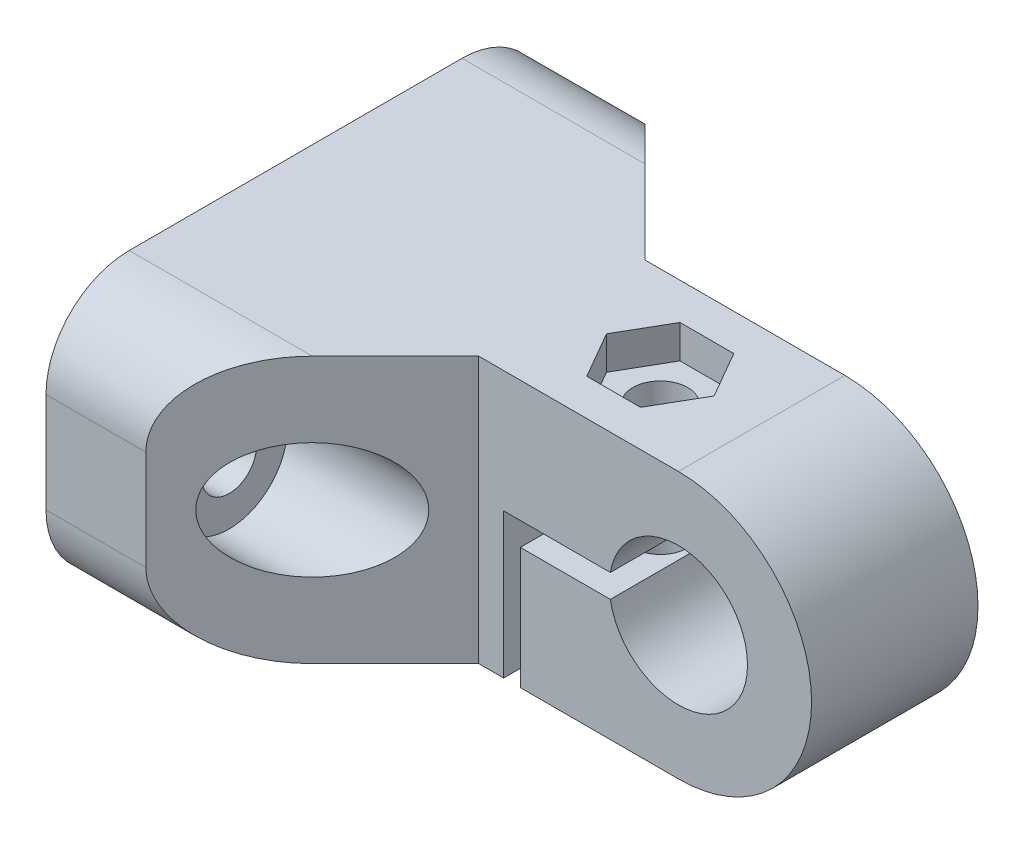
ISO-10303-21;
HEADER;
FILE_DESCRIPTION(('STEP AP214'),'2;1');
FILE_NAME('part.step','',(''),(''),'','','');
FILE_SCHEMA(('AUTOMOTIVE_DESIGN { 1 0 10303 214 1 1 1 1 }'));
ENDSEC;
DATA;
#1=APPLICATION_CONTEXT('core data for automotive mechanical design processes');
#2=APPLICATION_PROTOCOL_DEFINITION('international standard','automotive_design',2000,#1);
#3=PRODUCT_CONTEXT('',#1,'mechanical');
#4=PRODUCT('Part','Part','',(#3));
#5=PRODUCT_RELATED_PRODUCT_CATEGORY('part','',(#4));
#6=PRODUCT_DEFINITION_FORMATION('','',#4);
#7=PRODUCT_DEFINITION_CONTEXT('part definition',#1,'design');
#8=PRODUCT_DEFINITION('design','',#6,#7);
#9=PRODUCT_DEFINITION_SHAPE('','',#8);
#10=(LENGTH_UNIT() NAMED_UNIT(*) SI_UNIT(.MILLI.,.METRE.));
#11=(NAMED_UNIT(*) PLANE_ANGLE_UNIT() SI_UNIT($,.RADIAN.));
#12=(NAMED_UNIT(*) SI_UNIT($,.STERADIAN.) SOLID_ANGLE_UNIT());
#13=UNCERTAINTY_MEASURE_WITH_UNIT(LENGTH_MEASURE(1.E-05),#10,'distance_accuracy_value','');
#14=(GEOMETRIC_REPRESENTATION_CONTEXT(3) GLOBAL_UNCERTAINTY_ASSIGNED_CONTEXT((#13)) GLOBAL_UNIT_ASSIGNED_CONTEXT((#10,
#11,#12)) REPRESENTATION_CONTEXT('',''));
#15=CARTESIAN_POINT('',(0.,0.,0.));
#16=DIRECTION('',(0.,0.,1.));
#17=DIRECTION('',(1.,0.,0.));
#18=AXIS2_PLACEMENT_3D('',#15,#16,#17);
#19=CARTESIAN_POINT('',(8.,0.,5.));
#20=DIRECTION('',(-1.,0.,0.));
#21=DIRECTION('',(0.,0.,1.));
#22=AXIS2_PLACEMENT_3D('',#19,#20,#21);
#23=CYLINDRICAL_SURFACE('',#22,1.65);
#24=CARTESIAN_POINT('',(-28.,0.,5.));
#25=DIRECTION('',(1.,0.,0.));
#26=DIRECTION('',(0.,0.,-1.));
#27=AXIS2_PLACEMENT_3D('',#24,#25,#26);
#28=CIRCLE('',#27,1.65);
#29=CARTESIAN_POINT('',(-28.,0.,3.35));
#30=VERTEX_POINT('',#29);
#31=EDGE_CURVE('E232',#30,#30,#28,.T.);
#32=ORIENTED_EDGE('',*,*,#31,.F.);
#33=EDGE_LOOP('',(#32));
#34=FACE_BOUND('',#33,.T.);
#35=CARTESIAN_POINT('',(-22.,0.,5.));
#36=DIRECTION('',(1.,0.,0.));
#37=DIRECTION('',(0.,0.,-1.));
#38=AXIS2_PLACEMENT_3D('',#35,#36,#37);
#39=CIRCLE('',#38,1.65);
#40=CARTESIAN_POINT('',(-22.,0.,3.35));
#41=VERTEX_POINT('',#40);
#42=EDGE_CURVE('E416',#41,#41,#39,.T.);
#43=ORIENTED_EDGE('',*,*,#42,.T.);
#44=EDGE_LOOP('',(#43));
#45=FACE_BOUND('',#44,.T.);
#46=ADVANCED_FACE('F37',(#34,#45),#23,.F.);
#47=CARTESIAN_POINT('',(8.,0.,25.));
#48=DIRECTION('',(-1.,0.,0.));
#49=DIRECTION('',(0.,0.,1.));
#50=AXIS2_PLACEMENT_3D('',#47,#48,#49);
#51=CYLINDRICAL_SURFACE('',#50,1.65);
#52=CARTESIAN_POINT('',(-28.,0.,25.));
#53=DIRECTION('',(1.,0.,0.));
#54=DIRECTION('',(0.,0.,1.));
#55=AXIS2_PLACEMENT_3D('',#52,#53,#54);
#56=CIRCLE('',#55,1.65);
#57=CARTESIAN_POINT('',(-28.,0.,26.65));
#58=VERTEX_POINT('',#57);
#59=EDGE_CURVE('E415',#58,#58,#56,.T.);
#60=ORIENTED_EDGE('',*,*,#59,.F.);
#61=EDGE_LOOP('',(#60));
#62=FACE_BOUND('',#61,.T.);
#63=CARTESIAN_POINT('',(-22.,0.,25.));
#64=DIRECTION('',(1.,0.,0.));
#65=DIRECTION('',(0.,0.,-1.));
#66=AXIS2_PLACEMENT_3D('',#63,#64,#65);
#67=CIRCLE('',#66,1.65);
#68=CARTESIAN_POINT('',(-22.,0.,23.35));
#69=VERTEX_POINT('',#68);
#70=EDGE_CURVE('E409',#69,#69,#67,.T.);
#71=ORIENTED_EDGE('',*,*,#70,.T.);
#72=EDGE_LOOP('',(#71));
#73=FACE_BOUND('',#72,.T.);
#74=ADVANCED_FACE('F438',(#62,#73),#51,.F.);
#75=CARTESIAN_POINT('',(-6.09053786194432,8.,15.));
#76=DIRECTION('',(0.,-1.,0.));
#77=DIRECTION('',(1.,0.,0.));
#78=AXIS2_PLACEMENT_3D('',#75,#76,#77);
#79=CYLINDRICAL_SURFACE('',#78,1.65);
#80=CARTESIAN_POINT('',(-6.09053786194432,0.699999999999999,15.));
#81=DIRECTION('',(0.,1.,0.));
#82=DIRECTION('',(-1.,0.,0.));
#83=AXIS2_PLACEMENT_3D('',#80,#81,#82);
#84=CIRCLE('',#83,1.65);
#85=CARTESIAN_POINT('',(-7.74053786194432,0.699999999999999,15.));
#86=VERTEX_POINT('',#85);
#87=EDGE_CURVE('E269',#86,#86,#84,.T.);
#88=ORIENTED_EDGE('',*,*,#87,.F.);
#89=EDGE_LOOP('',(#88));
#90=FACE_BOUND('',#89,.T.);
#91=CARTESIAN_POINT('',(-6.09053786194432,6.,15.));
#92=DIRECTION('',(0.,1.,0.));
#93=DIRECTION('',(0.,0.,1.));
#94=AXIS2_PLACEMENT_3D('',#91,#92,#93);
#95=CIRCLE('',#94,1.65);
#96=CARTESIAN_POINT('',(-6.09053786194432,6.,16.65));
#97=VERTEX_POINT('',#96);
#98=EDGE_CURVE('E255',#97,#97,#95,.F.);
#99=ORIENTED_EDGE('',*,*,#98,.F.);
#100=EDGE_LOOP('',(#99));
#101=FACE_BOUND('',#100,.T.);
#102=ADVANCED_FACE('F443',(#90,#101),#79,.F.);
#103=CARTESIAN_POINT('',(-28.,-8.,30.));
#104=DIRECTION('',(0.,1.,0.));
#105=DIRECTION('',(0.,0.,1.));
#106=AXIS2_PLACEMENT_3D('',#103,#104,#105);
#107=PLANE('',#106);
#108=DIRECTION('',(0.,0.,-1.));
#109=VECTOR('',#108,1.);
#110=CARTESIAN_POINT('',(-28.,-8.,30.));
#111=LINE('',#110,#109);
#112=CARTESIAN_POINT('',(-28.,-8.,25.));
#113=VERTEX_POINT('',#112);
#114=CARTESIAN_POINT('',(-28.,-8.,5.));
#115=VERTEX_POINT('',#114);
#116=EDGE_CURVE('E343',#113,#115,#111,.T.);
#117=ORIENTED_EDGE('',*,*,#116,.T.);
#118=DIRECTION('',(1.,0.,0.));
#119=VECTOR('',#118,1.);
#120=CARTESIAN_POINT('',(-28.,-8.,5.));
#121=LINE('',#120,#119);
#122=CARTESIAN_POINT('',(-16.9999999999999,-8.,5.));
#123=VERTEX_POINT('',#122);
#124=EDGE_CURVE('E379',#115,#123,#121,.T.);
#125=ORIENTED_EDGE('',*,*,#124,.T.);
#126=DIRECTION('',(0.707106781186551,0.,0.707106781186544));
#127=VECTOR('',#126,1.);
#128=CARTESIAN_POINT('',(-22.,-8.,0.));
#129=LINE('',#128,#127);
#130=CARTESIAN_POINT('',(-11.9999999999999,-8.,10.));
#131=VERTEX_POINT('',#130);
#132=EDGE_CURVE('E273',#123,#131,#129,.T.);
#133=ORIENTED_EDGE('',*,*,#132,.T.);
#134=DIRECTION('',(1.,0.,0.));
#135=VECTOR('',#134,1.);
#136=CARTESIAN_POINT('',(-11.9999999999999,-8.,10.));
#137=LINE('',#136,#135);
#138=CARTESIAN_POINT('',(-10.5,-8.,10.));
#139=VERTEX_POINT('',#138);
#140=EDGE_CURVE('E277',#131,#139,#137,.T.);
#141=ORIENTED_EDGE('',*,*,#140,.T.);
#142=DIRECTION('',(0.,0.,-1.));
#143=VECTOR('',#142,1.);
#144=CARTESIAN_POINT('',(-10.5,-8.,30.));
#145=LINE('',#144,#143);
#146=CARTESIAN_POINT('',(-10.5,-8.,20.));
#147=VERTEX_POINT('',#146);
#148=EDGE_CURVE('E372',#147,#139,#145,.T.);
#149=ORIENTED_EDGE('',*,*,#148,.F.);
#150=DIRECTION('',(-1.,0.,0.));
#151=VECTOR('',#150,1.);
#152=CARTESIAN_POINT('',(-11.9999999999999,-8.,20.));
#153=LINE('',#152,#151);
#154=CARTESIAN_POINT('',(-11.9999999999999,-8.,20.));
#155=VERTEX_POINT('',#154);
#156=EDGE_CURVE('E307',#147,#155,#153,.T.);
#157=ORIENTED_EDGE('',*,*,#156,.T.);
#158=DIRECTION('',(-0.707106781186551,0.,0.707106781186544));
#159=VECTOR('',#158,1.);
#160=CARTESIAN_POINT('',(-22.,-8.,30.));
#161=LINE('',#160,#159);
#162=CARTESIAN_POINT('',(-16.9999999999999,-8.,25.));
#163=VERTEX_POINT('',#162);
#164=EDGE_CURVE('E312',#155,#163,#161,.T.);
#165=ORIENTED_EDGE('',*,*,#164,.T.);
#166=DIRECTION('',(1.,0.,0.));
#167=VECTOR('',#166,1.);
#168=CARTESIAN_POINT('',(-28.,-8.,25.));
#169=LINE('',#168,#167);
#170=EDGE_CURVE('E375',#163,#113,#169,.F.);
#171=ORIENTED_EDGE('',*,*,#170,.T.);
#172=EDGE_LOOP('',(#117,#125,#133,#141,#149,#157,#165,#171));
#173=FACE_BOUND('',#172,.T.);
#174=ADVANCED_FACE('F474',(#173),#107,.F.);
#175=CARTESIAN_POINT('',(-10.5,0.699999999999999,30.));
#176=DIRECTION('',(-1.,0.,0.));
#177=DIRECTION('',(0.,-1.,0.));
#178=AXIS2_PLACEMENT_3D('',#175,#176,#177);
#179=PLANE('',#178);
#180=ORIENTED_EDGE('',*,*,#148,.T.);
#181=DIRECTION('',(0.,1.,0.));
#182=VECTOR('',#181,1.);
#183=CARTESIAN_POINT('',(-10.5,0.699999999999999,10.));
#184=LINE('',#183,#182);
#185=CARTESIAN_POINT('',(-10.5,0.699999999999999,10.));
#186=VERTEX_POINT('',#185);
#187=EDGE_CURVE('E303',#139,#186,#184,.T.);
#188=ORIENTED_EDGE('',*,*,#187,.T.);
#189=DIRECTION('',(0.,0.,-1.));
#190=VECTOR('',#189,1.);
#191=CARTESIAN_POINT('',(-10.5,0.699999999999999,30.));
#192=LINE('',#191,#190);
#193=CARTESIAN_POINT('',(-10.5,0.699999999999999,20.));
#194=VERTEX_POINT('',#193);
#195=EDGE_CURVE('E369',#194,#186,#192,.T.);
#196=ORIENTED_EDGE('',*,*,#195,.F.);
#197=DIRECTION('',(0.,-1.,0.));
#198=VECTOR('',#197,1.);
#199=CARTESIAN_POINT('',(-10.5,0.699999999999999,20.));
#200=LINE('',#199,#198);
#201=EDGE_CURVE('E336',#194,#147,#200,.T.);
#202=ORIENTED_EDGE('',*,*,#201,.T.);
#203=EDGE_LOOP('',(#180,#188,#196,#202));
#204=FACE_BOUND('',#203,.T.);
#205=ADVANCED_FACE('F529',(#204),#179,.F.);
#206=CARTESIAN_POINT('',(-4.09053786194432,0.7,30.));
#207=DIRECTION('',(0.,1.,0.));
#208=DIRECTION('',(-1.,0.,0.));
#209=AXIS2_PLACEMENT_3D('',#206,#207,#208);
#210=PLANE('',#209);
#211=ORIENTED_EDGE('',*,*,#87,.T.);
#212=EDGE_LOOP('',(#211));
#213=FACE_BOUND('',#212,.T.);
#214=ORIENTED_EDGE('',*,*,#195,.T.);
#215=DIRECTION('',(1.,0.,0.));
#216=VECTOR('',#215,1.);
#217=CARTESIAN_POINT('',(-4.09053786194432,0.7,10.));
#218=LINE('',#217,#216);
#219=CARTESIAN_POINT('',(-4.09053786194432,0.699999999999999,10.));
#220=VERTEX_POINT('',#219);
#221=EDGE_CURVE('E300',#186,#220,#218,.T.);
#222=ORIENTED_EDGE('',*,*,#221,.T.);
#223=DIRECTION('',(0.,0.,-1.));
#224=VECTOR('',#223,1.);
#225=CARTESIAN_POINT('',(-4.09053786194432,0.699999999999999,30.));
#226=LINE('',#225,#224);
#227=CARTESIAN_POINT('',(-4.09053786194432,0.699999999999999,20.));
#228=VERTEX_POINT('',#227);
#229=EDGE_CURVE('E366',#228,#220,#226,.T.);
#230=ORIENTED_EDGE('',*,*,#229,.F.);
#231=DIRECTION('',(-1.,0.,0.));
#232=VECTOR('',#231,1.);
#233=CARTESIAN_POINT('',(-4.09053786194432,0.7,20.));
#234=LINE('',#233,#232);
#235=EDGE_CURVE('E333',#228,#194,#234,.T.);
#236=ORIENTED_EDGE('',*,*,#235,.T.);
#237=EDGE_LOOP('',(#214,#222,#230,#236));
#238=FACE_BOUND('',#237,.T.);
#239=ADVANCED_FACE('F525',(#213,#238),#210,.F.);
#240=CARTESIAN_POINT('',(0.,0.,30.));
#241=DIRECTION('',(0.,0.,-1.));
#242=DIRECTION('',(-1.,0.,0.));
#243=AXIS2_PLACEMENT_3D('',#240,#241,#242);
#244=CYLINDRICAL_SURFACE('',#243,4.15);
#245=ORIENTED_EDGE('',*,*,#229,.T.);
#246=CARTESIAN_POINT('',(0.,0.,10.));
#247=DIRECTION('',(0.,0.,1.));
#248=DIRECTION('',(1.,0.,0.));
#249=AXIS2_PLACEMENT_3D('',#246,#247,#248);
#250=CIRCLE('',#249,4.15);
#251=CARTESIAN_POINT('',(-4.09053786194432,-0.7,10.));
#252=VERTEX_POINT('',#251);
#253=EDGE_CURVE('E297',#220,#252,#250,.F.);
#254=ORIENTED_EDGE('',*,*,#253,.T.);
#255=DIRECTION('',(0.,0.,-1.));
#256=VECTOR('',#255,1.);
#257=CARTESIAN_POINT('',(-4.09053786194432,-0.7,30.));
#258=LINE('',#257,#256);
#259=CARTESIAN_POINT('',(-4.09053786194432,-0.7,20.));
#260=VERTEX_POINT('',#259);
#261=EDGE_CURVE('E363',#260,#252,#258,.T.);
#262=ORIENTED_EDGE('',*,*,#261,.F.);
#263=CARTESIAN_POINT('',(0.,0.,20.));
#264=DIRECTION('',(0.,0.,-1.));
#265=DIRECTION('',(-1.,0.,0.));
#266=AXIS2_PLACEMENT_3D('',#263,#264,#265);
#267=CIRCLE('',#266,4.15);
#268=EDGE_CURVE('E330',#260,#228,#267,.F.);
#269=ORIENTED_EDGE('',*,*,#268,.T.);
#270=EDGE_LOOP('',(#245,#254,#262,#269));
#271=FACE_BOUND('',#270,.T.);
#272=ADVANCED_FACE('F521',(#271),#244,.F.);
#273=CARTESIAN_POINT('',(-4.09053786194432,-0.7,30.));
#274=DIRECTION('',(0.,-1.,0.));
#275=DIRECTION('',(1.,0.,0.));
#276=AXIS2_PLACEMENT_3D('',#273,#274,#275);
#277=PLANE('',#276);
#278=CARTESIAN_POINT('',(-6.09053786194432,-0.699999999999999,15.));
#279=DIRECTION('',(0.,-1.,0.));
#280=DIRECTION('',(1.,0.,0.));
#281=AXIS2_PLACEMENT_3D('',#278,#279,#280);
#282=CIRCLE('',#281,1.65);
#283=CARTESIAN_POINT('',(-4.44053786194432,-0.699999999999999,15.));
#284=VERTEX_POINT('',#283);
#285=EDGE_CURVE('E266',#284,#284,#282,.T.);
#286=ORIENTED_EDGE('',*,*,#285,.T.);
#287=EDGE_LOOP('',(#286));
#288=FACE_BOUND('',#287,.T.);
#289=ORIENTED_EDGE('',*,*,#261,.T.);
#290=DIRECTION('',(-1.,0.,0.));
#291=VECTOR('',#290,1.);
#292=CARTESIAN_POINT('',(-4.09053786194432,-0.7,10.));
#293=LINE('',#292,#291);
#294=CARTESIAN_POINT('',(-9.5,-0.700000000000001,10.));
#295=VERTEX_POINT('',#294);
#296=EDGE_CURVE('E294',#252,#295,#293,.T.);
#297=ORIENTED_EDGE('',*,*,#296,.T.);
#298=DIRECTION('',(0.,0.,-1.));
#299=VECTOR('',#298,1.);
#300=CARTESIAN_POINT('',(-9.5,-0.700000000000001,30.));
#301=LINE('',#300,#299);
#302=CARTESIAN_POINT('',(-9.5,-0.700000000000001,20.));
#303=VERTEX_POINT('',#302);
#304=EDGE_CURVE('E360',#303,#295,#301,.T.);
#305=ORIENTED_EDGE('',*,*,#304,.F.);
#306=DIRECTION('',(1.,0.,0.));
#307=VECTOR('',#306,1.);
#308=CARTESIAN_POINT('',(-4.09053786194432,-0.7,20.));
#309=LINE('',#308,#307);
#310=EDGE_CURVE('E327',#303,#260,#309,.T.);
#311=ORIENTED_EDGE('',*,*,#310,.T.);
#312=EDGE_LOOP('',(#289,#297,#305,#311));
#313=FACE_BOUND('',#312,.T.);
#314=ADVANCED_FACE('F517',(#288,#313),#277,.F.);
#315=CARTESIAN_POINT('',(-9.5,-0.700000000000001,30.));
#316=DIRECTION('',(1.,0.,0.));
#317=DIRECTION('',(0.,0.,-1.));
#318=AXIS2_PLACEMENT_3D('',#315,#316,#317);
#319=PLANE('',#318);
#320=ORIENTED_EDGE('',*,*,#304,.T.);
#321=DIRECTION('',(0.,-1.,0.));
#322=VECTOR('',#321,1.);
#323=CARTESIAN_POINT('',(-9.5,-0.700000000000001,10.));
#324=LINE('',#323,#322);
#325=CARTESIAN_POINT('',(-9.5,-8.,10.));
#326=VERTEX_POINT('',#325);
#327=EDGE_CURVE('E291',#295,#326,#324,.T.);
#328=ORIENTED_EDGE('',*,*,#327,.T.);
#329=DIRECTION('',(0.,0.,-1.));
#330=VECTOR('',#329,1.);
#331=CARTESIAN_POINT('',(-9.5,-8.,30.));
#332=LINE('',#331,#330);
#333=CARTESIAN_POINT('',(-9.5,-8.,20.));
#334=VERTEX_POINT('',#333);
#335=EDGE_CURVE('E357',#334,#326,#332,.T.);
#336=ORIENTED_EDGE('',*,*,#335,.F.);
#337=DIRECTION('',(0.,1.,0.));
#338=VECTOR('',#337,1.);
#339=CARTESIAN_POINT('',(-9.5,-0.700000000000001,20.));
#340=LINE('',#339,#338);
#341=EDGE_CURVE('E324',#334,#303,#340,.T.);
#342=ORIENTED_EDGE('',*,*,#341,.T.);
#343=EDGE_LOOP('',(#320,#328,#336,#342));
#344=FACE_BOUND('',#343,.T.);
#345=ADVANCED_FACE('F513',(#344),#319,.F.);
#346=CARTESIAN_POINT('',(-9.5,-8.,30.));
#347=DIRECTION('',(0.,1.,0.));
#348=DIRECTION('',(0.,0.,1.));
#349=AXIS2_PLACEMENT_3D('',#346,#347,#348);
#350=PLANE('',#349);
#351=CARTESIAN_POINT('',(-6.09053786194432,-8.,15.));
#352=DIRECTION('',(0.,-1.,0.));
#353=DIRECTION('',(1.,0.,0.));
#354=AXIS2_PLACEMENT_3D('',#351,#352,#353);
#355=CIRCLE('',#354,1.65);
#356=CARTESIAN_POINT('',(-4.44053786194432,-8.,15.));
#357=VERTEX_POINT('',#356);
#358=EDGE_CURVE('E263',#357,#357,#355,.T.);
#359=ORIENTED_EDGE('',*,*,#358,.F.);
#360=EDGE_LOOP('',(#359));
#361=FACE_BOUND('',#360,.T.);
#362=ORIENTED_EDGE('',*,*,#335,.T.);
#363=CARTESIAN_POINT('',(0.,-8.,10.));
#364=VERTEX_POINT('',#363);
#365=EDGE_CURVE('E275',#326,#364,#137,.T.);
#366=ORIENTED_EDGE('',*,*,#365,.T.);
#367=DIRECTION('',(0.,0.,-1.));
#368=VECTOR('',#367,1.);
#369=CARTESIAN_POINT('',(0.,-8.,30.));
#370=LINE('',#369,#368);
#371=CARTESIAN_POINT('',(0.,-8.,20.));
#372=VERTEX_POINT('',#371);
#373=EDGE_CURVE('E354',#372,#364,#370,.T.);
#374=ORIENTED_EDGE('',*,*,#373,.F.);
#375=EDGE_CURVE('E310',#372,#334,#153,.T.);
#376=ORIENTED_EDGE('',*,*,#375,.T.);
#377=EDGE_LOOP('',(#362,#366,#374,#376));
#378=FACE_BOUND('',#377,.T.);
#379=ADVANCED_FACE('F509',(#361,#378),#350,.F.);
#380=CARTESIAN_POINT('',(0.,0.,30.));
#381=DIRECTION('',(0.,0.,-1.));
#382=DIRECTION('',(-1.,0.,0.));
#383=AXIS2_PLACEMENT_3D('',#380,#381,#382);
#384=CYLINDRICAL_SURFACE('',#383,8.);
#385=CARTESIAN_POINT('',(0.,0.,10.));
#386=DIRECTION('',(0.,0.,1.));
#387=DIRECTION('',(1.,0.,0.));
#388=AXIS2_PLACEMENT_3D('',#385,#386,#387);
#389=CIRCLE('',#388,8.);
#390=CARTESIAN_POINT('',(0.,8.,10.));
#391=VERTEX_POINT('',#390);
#392=EDGE_CURVE('E287',#364,#391,#389,.T.);
#393=ORIENTED_EDGE('',*,*,#392,.T.);
#394=DIRECTION('',(0.,0.,-1.));
#395=VECTOR('',#394,1.);
#396=CARTESIAN_POINT('',(0.,8.,30.));
#397=LINE('',#396,#395);
#398=CARTESIAN_POINT('',(0.,8.,20.));
#399=VERTEX_POINT('',#398);
#400=EDGE_CURVE('E351',#399,#391,#397,.T.);
#401=ORIENTED_EDGE('',*,*,#400,.F.);
#402=CARTESIAN_POINT('',(0.,0.,20.));
#403=DIRECTION('',(0.,0.,-1.));
#404=DIRECTION('',(-1.,0.,0.));
#405=AXIS2_PLACEMENT_3D('',#402,#403,#404);
#406=CIRCLE('',#405,8.);
#407=EDGE_CURVE('E320',#399,#372,#406,.T.);
#408=ORIENTED_EDGE('',*,*,#407,.T.);
#409=ORIENTED_EDGE('',*,*,#373,.T.);
#410=EDGE_LOOP('',(#393,#401,#408,#409));
#411=FACE_BOUND('',#410,.T.);
#412=ADVANCED_FACE('F505',(#411),#384,.T.);
#413=CARTESIAN_POINT('',(0.,8.,30.));
#414=DIRECTION('',(0.,-1.,0.));
#415=DIRECTION('',(0.,0.,-1.));
#416=AXIS2_PLACEMENT_3D('',#413,#414,#415);
#417=PLANE('',#416);
#418=DIRECTION('',(-0.500000000000001,0.,-0.866025403784438));
#419=VECTOR('',#418,1.);
#420=CARTESIAN_POINT('',(-2.85737635448242,8.,15.));
#421=LINE('',#420,#419);
#422=CARTESIAN_POINT('',(-2.85737635448241,8.,15.));
#423=VERTEX_POINT('',#422);
#424=CARTESIAN_POINT('',(-4.47395710821337,8.,12.2));
#425=VERTEX_POINT('',#424);
#426=EDGE_CURVE('E243',#423,#425,#421,.T.);
#427=ORIENTED_EDGE('',*,*,#426,.F.);
#428=DIRECTION('',(0.499999999999999,0.,-0.866025403784439));
#429=VECTOR('',#428,1.);
#430=CARTESIAN_POINT('',(-4.47395710821337,8.,17.8));
#431=LINE('',#430,#429);
#432=CARTESIAN_POINT('',(-4.47395710821337,8.,17.8));
#433=VERTEX_POINT('',#432);
#434=EDGE_CURVE('E207',#433,#423,#431,.T.);
#435=ORIENTED_EDGE('',*,*,#434,.F.);
#436=DIRECTION('',(1.,0.,0.));
#437=VECTOR('',#436,1.);
#438=CARTESIAN_POINT('',(-7.70711861567527,8.,17.8));
#439=LINE('',#438,#437);
#440=CARTESIAN_POINT('',(-7.70711861567527,8.,17.8));
#441=VERTEX_POINT('',#440);
#442=EDGE_CURVE('E226',#441,#433,#439,.T.);
#443=ORIENTED_EDGE('',*,*,#442,.F.);
#444=DIRECTION('',(0.5,0.,0.866025403784439));
#445=VECTOR('',#444,1.);
#446=CARTESIAN_POINT('',(-9.32369936940622,8.,15.));
#447=LINE('',#446,#445);
#448=CARTESIAN_POINT('',(-9.32369936940622,8.,15.));
#449=VERTEX_POINT('',#448);
#450=EDGE_CURVE('E229',#449,#441,#447,.T.);
#451=ORIENTED_EDGE('',*,*,#450,.F.);
#452=DIRECTION('',(-0.5,0.,0.866025403784439));
#453=VECTOR('',#452,1.);
#454=CARTESIAN_POINT('',(-7.70711861567527,8.,12.2));
#455=LINE('',#454,#453);
#456=CARTESIAN_POINT('',(-7.70711861567527,8.,12.2));
#457=VERTEX_POINT('',#456);
#458=EDGE_CURVE('E248',#457,#449,#455,.T.);
#459=ORIENTED_EDGE('',*,*,#458,.F.);
#460=DIRECTION('',(-1.,0.,0.));
#461=VECTOR('',#460,1.);
#462=CARTESIAN_POINT('',(-4.47395710821337,8.,12.2));
#463=LINE('',#462,#461);
#464=EDGE_CURVE('E245',#425,#457,#463,.T.);
#465=ORIENTED_EDGE('',*,*,#464,.F.);
#466=EDGE_LOOP('',(#427,#435,#443,#451,#459,#465));
#467=FACE_BOUND('',#466,.T.);
#468=DIRECTION('',(0.707106781186551,0.,0.707106781186544));
#469=VECTOR('',#468,1.);
#470=CARTESIAN_POINT('',(-22.,8.,0.));
#471=LINE('',#470,#469);
#472=CARTESIAN_POINT('',(-16.9999999999999,8.,5.));
#473=VERTEX_POINT('',#472);
#474=CARTESIAN_POINT('',(-11.9999999999999,8.,10.));
#475=VERTEX_POINT('',#474);
#476=EDGE_CURVE('E272',#473,#475,#471,.T.);
#477=ORIENTED_EDGE('',*,*,#476,.F.);
#478=DIRECTION('',(-1.,0.,0.));
#479=VECTOR('',#478,1.);
#480=CARTESIAN_POINT('',(0.,8.,5.));
#481=LINE('',#480,#479);
#482=CARTESIAN_POINT('',(-28.,8.,5.));
#483=VERTEX_POINT('',#482);
#484=EDGE_CURVE('E400',#473,#483,#481,.T.);
#485=ORIENTED_EDGE('',*,*,#484,.T.);
#486=DIRECTION('',(0.,0.,-1.));
#487=VECTOR('',#486,1.);
#488=CARTESIAN_POINT('',(-28.,8.,30.));
#489=LINE('',#488,#487);
#490=CARTESIAN_POINT('',(-28.,8.,25.));
#491=VERTEX_POINT('',#490);
#492=EDGE_CURVE('E348',#491,#483,#489,.T.);
#493=ORIENTED_EDGE('',*,*,#492,.F.);
#494=DIRECTION('',(-1.,0.,0.));
#495=VECTOR('',#494,1.);
#496=CARTESIAN_POINT('',(-22.,8.,25.));
#497=LINE('',#496,#495);
#498=CARTESIAN_POINT('',(-16.9999999999999,8.,25.));
#499=VERTEX_POINT('',#498);
#500=EDGE_CURVE('E398',#491,#499,#497,.F.);
#501=ORIENTED_EDGE('',*,*,#500,.T.);
#502=DIRECTION('',(-0.707106781186551,0.,0.707106781186544));
#503=VECTOR('',#502,1.);
#504=CARTESIAN_POINT('',(-22.,8.,30.));
#505=LINE('',#504,#503);
#506=CARTESIAN_POINT('',(-11.9999999999999,8.,20.));
#507=VERTEX_POINT('',#506);
#508=EDGE_CURVE('E311',#507,#499,#505,.T.);
#509=ORIENTED_EDGE('',*,*,#508,.F.);
#510=DIRECTION('',(-1.,0.,0.));
#511=VECTOR('',#510,1.);
#512=CARTESIAN_POINT('',(-11.9999999999999,8.,20.));
#513=LINE('',#512,#511);
#514=EDGE_CURVE('E306',#399,#507,#513,.T.);
#515=ORIENTED_EDGE('',*,*,#514,.F.);
#516=ORIENTED_EDGE('',*,*,#400,.T.);
#517=DIRECTION('',(1.,0.,0.));
#518=VECTOR('',#517,1.);
#519=CARTESIAN_POINT('',(-11.9999999999999,8.,10.));
#520=LINE('',#519,#518);
#521=EDGE_CURVE('E276',#475,#391,#520,.T.);
#522=ORIENTED_EDGE('',*,*,#521,.F.);
#523=EDGE_LOOP('',(#477,#485,#493,#501,#509,#515,#516,#522));
#524=FACE_BOUND('',#523,.T.);
#525=ADVANCED_FACE('F502',(#467,#524),#417,.F.);
#526=CARTESIAN_POINT('',(-28.,8.,30.));
#527=DIRECTION('',(1.,0.,0.));
#528=DIRECTION('',(0.,0.,-1.));
#529=AXIS2_PLACEMENT_3D('',#526,#527,#528);
#530=PLANE('',#529);
#531=ORIENTED_EDGE('',*,*,#59,.T.);
#532=EDGE_LOOP('',(#531));
#533=FACE_BOUND('',#532,.T.);
#534=ORIENTED_EDGE('',*,*,#31,.T.);
#535=EDGE_LOOP('',(#534));
#536=FACE_BOUND('',#535,.T.);
#537=DIRECTION('',(0.,-1.,0.));
#538=VECTOR('',#537,1.);
#539=CARTESIAN_POINT('',(-28.,8.,0.));
#540=LINE('',#539,#538);
#541=CARTESIAN_POINT('',(-28.,3.,0.));
#542=VERTEX_POINT('',#541);
#543=CARTESIAN_POINT('',(-28.,-3.,0.));
#544=VERTEX_POINT('',#543);
#545=EDGE_CURVE('E339',#542,#544,#540,.T.);
#546=ORIENTED_EDGE('',*,*,#545,.T.);
#547=CARTESIAN_POINT('',(-28.,-3.,5.));
#548=DIRECTION('',(1.,0.,0.));
#549=DIRECTION('',(0.,0.,-1.));
#550=AXIS2_PLACEMENT_3D('',#547,#548,#549);
#551=CIRCLE('',#550,5.);
#552=EDGE_CURVE('E396',#544,#115,#551,.F.);
#553=ORIENTED_EDGE('',*,*,#552,.T.);
#554=ORIENTED_EDGE('',*,*,#116,.F.);
#555=CARTESIAN_POINT('',(-28.,-3.,25.));
#556=DIRECTION('',(1.,0.,0.));
#557=DIRECTION('',(0.,0.,-1.));
#558=AXIS2_PLACEMENT_3D('',#555,#556,#557);
#559=CIRCLE('',#558,5.);
#560=CARTESIAN_POINT('',(-28.,-3.,30.));
#561=VERTEX_POINT('',#560);
#562=EDGE_CURVE('E392',#113,#561,#559,.F.);
#563=ORIENTED_EDGE('',*,*,#562,.T.);
#564=DIRECTION('',(0.,-1.,0.));
#565=VECTOR('',#564,1.);
#566=CARTESIAN_POINT('',(-28.,8.,30.));
#567=LINE('',#566,#565);
#568=CARTESIAN_POINT('',(-28.,3.,30.));
#569=VERTEX_POINT('',#568);
#570=EDGE_CURVE('E340',#569,#561,#567,.T.);
#571=ORIENTED_EDGE('',*,*,#570,.F.);
#572=CARTESIAN_POINT('',(-28.,3.,25.));
#573=DIRECTION('',(1.,0.,0.));
#574=DIRECTION('',(0.,0.,-1.));
#575=AXIS2_PLACEMENT_3D('',#572,#573,#574);
#576=CIRCLE('',#575,5.);
#577=EDGE_CURVE('E390',#569,#491,#576,.F.);
#578=ORIENTED_EDGE('',*,*,#577,.T.);
#579=ORIENTED_EDGE('',*,*,#492,.T.);
#580=CARTESIAN_POINT('',(-28.,3.,5.));
#581=DIRECTION('',(1.,0.,0.));
#582=DIRECTION('',(0.,0.,-1.));
#583=AXIS2_PLACEMENT_3D('',#580,#581,#582);
#584=CIRCLE('',#583,5.);
#585=EDGE_CURVE('E394',#483,#542,#584,.F.);
#586=ORIENTED_EDGE('',*,*,#585,.T.);
#587=EDGE_LOOP('',(#546,#553,#554,#563,#571,#578,#579,#586));
#588=FACE_BOUND('',#587,.T.);
#589=ADVANCED_FACE('F434',(#533,#536,#588),#530,.F.);
#590=CARTESIAN_POINT('',(0.,0.,30.));
#591=DIRECTION('',(0.,0.,1.));
#592=DIRECTION('',(1.,0.,0.));
#593=AXIS2_PLACEMENT_3D('',#590,#591,#592);
#594=PLANE('',#593);
#595=ORIENTED_EDGE('',*,*,#570,.T.);
#596=DIRECTION('',(1.,0.,0.));
#597=VECTOR('',#596,1.);
#598=CARTESIAN_POINT('',(-22.,-3.,30.));
#599=LINE('',#598,#597);
#600=CARTESIAN_POINT('',(-22.,-3.,30.));
#601=VERTEX_POINT('',#600);
#602=EDGE_CURVE('E406',#561,#601,#599,.T.);
#603=ORIENTED_EDGE('',*,*,#602,.T.);
#604=DIRECTION('',(0.,1.,0.));
#605=VECTOR('',#604,1.);
#606=CARTESIAN_POINT('',(-22.,-8.,30.));
#607=LINE('',#606,#605);
#608=CARTESIAN_POINT('',(-22.,3.,30.));
#609=VERTEX_POINT('',#608);
#610=EDGE_CURVE('E318',#601,#609,#607,.T.);
#611=ORIENTED_EDGE('',*,*,#610,.T.);
#612=DIRECTION('',(-1.,0.,0.));
#613=VECTOR('',#612,1.);
#614=CARTESIAN_POINT('',(-28.,3.,30.));
#615=LINE('',#614,#613);
#616=EDGE_CURVE('E403',#609,#569,#615,.T.);
#617=ORIENTED_EDGE('',*,*,#616,.T.);
#618=EDGE_LOOP('',(#595,#603,#611,#617));
#619=FACE_BOUND('',#618,.T.);
#620=ADVANCED_FACE('F493',(#619),#594,.T.);
#621=CARTESIAN_POINT('',(0.,0.,0.));
#622=DIRECTION('',(0.,0.,1.));
#623=DIRECTION('',(1.,0.,0.));
#624=AXIS2_PLACEMENT_3D('',#621,#622,#623);
#625=PLANE('',#624);
#626=DIRECTION('',(0.,1.,0.));
#627=VECTOR('',#626,1.);
#628=CARTESIAN_POINT('',(-22.,-8.,0.));
#629=LINE('',#628,#627);
#630=CARTESIAN_POINT('',(-22.,-3.,0.));
#631=VERTEX_POINT('',#630);
#632=CARTESIAN_POINT('',(-22.,3.,0.));
#633=VERTEX_POINT('',#632);
#634=EDGE_CURVE('E280',#631,#633,#629,.T.);
#635=ORIENTED_EDGE('',*,*,#634,.F.);
#636=DIRECTION('',(1.,0.,0.));
#637=VECTOR('',#636,1.);
#638=CARTESIAN_POINT('',(0.,-3.,0.));
#639=LINE('',#638,#637);
#640=EDGE_CURVE('E388',#631,#544,#639,.F.);
#641=ORIENTED_EDGE('',*,*,#640,.T.);
#642=ORIENTED_EDGE('',*,*,#545,.F.);
#643=DIRECTION('',(-1.,0.,0.));
#644=VECTOR('',#643,1.);
#645=CARTESIAN_POINT('',(0.,3.,0.));
#646=LINE('',#645,#644);
#647=EDGE_CURVE('E386',#542,#633,#646,.F.);
#648=ORIENTED_EDGE('',*,*,#647,.T.);
#649=EDGE_LOOP('',(#635,#641,#642,#648));
#650=FACE_BOUND('',#649,.T.);
#651=ADVANCED_FACE('F491',(#650),#625,.F.);
#652=CARTESIAN_POINT('',(-11.9999999999999,-8.,20.));
#653=DIRECTION('',(0.,0.,-1.));
#654=DIRECTION('',(-1.,0.,0.));
#655=AXIS2_PLACEMENT_3D('',#652,#653,#654);
#656=PLANE('',#655);
#657=ORIENTED_EDGE('',*,*,#235,.F.);
#658=ORIENTED_EDGE('',*,*,#268,.F.);
#659=ORIENTED_EDGE('',*,*,#310,.F.);
#660=ORIENTED_EDGE('',*,*,#341,.F.);
#661=ORIENTED_EDGE('',*,*,#375,.F.);
#662=ORIENTED_EDGE('',*,*,#407,.F.);
#663=ORIENTED_EDGE('',*,*,#514,.T.);
#664=DIRECTION('',(0.,1.,0.));
#665=VECTOR('',#664,1.);
#666=CARTESIAN_POINT('',(-11.9999999999999,-8.,20.));
#667=LINE('',#666,#665);
#668=EDGE_CURVE('E315',#155,#507,#667,.T.);
#669=ORIENTED_EDGE('',*,*,#668,.F.);
#670=ORIENTED_EDGE('',*,*,#156,.F.);
#671=ORIENTED_EDGE('',*,*,#201,.F.);
#672=EDGE_LOOP('',(#657,#658,#659,#660,#661,#662,#663,#669,#670,#671));
#673=FACE_BOUND('',#672,.T.);
#674=ADVANCED_FACE('F487',(#673),#656,.F.);
#675=CARTESIAN_POINT('',(-22.,-8.,30.));
#676=DIRECTION('',(-0.707106781186544,0.,-0.707106781186551));
#677=DIRECTION('',(-0.707106781186551,0.,0.707106781186544));
#678=AXIS2_PLACEMENT_3D('',#675,#676,#677);
#679=PLANE('',#678);
#680=CARTESIAN_POINT('',(-16.9999999999999,0.,25.));
#681=DIRECTION('',(-0.707106781186544,0.,-0.707106781186551));
#682=DIRECTION('',(0.707106781186551,0.,-0.707106781186544));
#683=AXIS2_PLACEMENT_3D('',#680,#681,#682);
#684=ELLIPSE('',#683,4.94974746830586,3.5);
#685=CARTESIAN_POINT('',(-13.4999999999999,0.,21.5));
#686=VERTEX_POINT('',#685);
#687=EDGE_CURVE('E412',#686,#686,#684,.T.);
#688=ORIENTED_EDGE('',*,*,#687,.T.);
#689=EDGE_LOOP('',(#688));
#690=FACE_BOUND('',#689,.T.);
#691=ORIENTED_EDGE('',*,*,#610,.F.);
#692=CARTESIAN_POINT('',(-16.9999999999999,-3.,25.));
#693=DIRECTION('',(-0.707106781186544,0.,-0.707106781186551));
#694=DIRECTION('',(-0.707106781186551,0.,0.707106781186544));
#695=AXIS2_PLACEMENT_3D('',#692,#693,#694);
#696=ELLIPSE('',#695,7.07106781186551,5.);
#697=EDGE_CURVE('E12',#601,#163,#696,.F.);
#698=ORIENTED_EDGE('',*,*,#697,.T.);
#699=ORIENTED_EDGE('',*,*,#164,.F.);
#700=ORIENTED_EDGE('',*,*,#668,.T.);
#701=ORIENTED_EDGE('',*,*,#508,.T.);
#702=CARTESIAN_POINT('',(-16.9999999999999,3.,25.));
#703=DIRECTION('',(-0.707106781186544,0.,-0.707106781186551));
#704=DIRECTION('',(0.707106781186551,0.,-0.707106781186544));
#705=AXIS2_PLACEMENT_3D('',#702,#703,#704);
#706=ELLIPSE('',#705,7.07106781186551,5.);
#707=EDGE_CURVE('E46',#499,#609,#706,.F.);
#708=ORIENTED_EDGE('',*,*,#707,.T.);
#709=EDGE_LOOP('',(#691,#698,#699,#700,#701,#708));
#710=FACE_BOUND('',#709,.T.);
#711=ADVANCED_FACE('F480',(#690,#710),#679,.F.);
#712=CARTESIAN_POINT('',(-11.9999999999999,-8.,10.));
#713=DIRECTION('',(0.,0.,1.));
#714=DIRECTION('',(1.,0.,0.));
#715=AXIS2_PLACEMENT_3D('',#712,#713,#714);
#716=PLANE('',#715);
#717=ORIENTED_EDGE('',*,*,#140,.F.);
#718=DIRECTION('',(0.,1.,0.));
#719=VECTOR('',#718,1.);
#720=CARTESIAN_POINT('',(-11.9999999999999,-8.,10.));
#721=LINE('',#720,#719);
#722=EDGE_CURVE('E284',#131,#475,#721,.T.);
#723=ORIENTED_EDGE('',*,*,#722,.T.);
#724=ORIENTED_EDGE('',*,*,#521,.T.);
#725=ORIENTED_EDGE('',*,*,#392,.F.);
#726=ORIENTED_EDGE('',*,*,#365,.F.);
#727=ORIENTED_EDGE('',*,*,#327,.F.);
#728=ORIENTED_EDGE('',*,*,#296,.F.);
#729=ORIENTED_EDGE('',*,*,#253,.F.);
#730=ORIENTED_EDGE('',*,*,#221,.F.);
#731=ORIENTED_EDGE('',*,*,#187,.F.);
#732=EDGE_LOOP('',(#717,#723,#724,#725,#726,#727,#728,#729,#730,#731));
#733=FACE_BOUND('',#732,.T.);
#734=ADVANCED_FACE('F476',(#733),#716,.F.);
#735=CARTESIAN_POINT('',(-22.,-8.,0.));
#736=DIRECTION('',(-0.707106781186544,0.,0.707106781186551));
#737=DIRECTION('',(0.707106781186551,0.,0.707106781186544));
#738=AXIS2_PLACEMENT_3D('',#735,#736,#737);
#739=PLANE('',#738);
#740=CARTESIAN_POINT('',(-16.9999999999999,0.,5.));
#741=DIRECTION('',(-0.707106781186544,0.,0.707106781186551));
#742=DIRECTION('',(0.707106781186551,0.,0.707106781186544));
#743=AXIS2_PLACEMENT_3D('',#740,#741,#742);
#744=ELLIPSE('',#743,4.94974746830586,3.5);
#745=CARTESIAN_POINT('',(-13.4999999999999,0.,8.5));
#746=VERTEX_POINT('',#745);
#747=EDGE_CURVE('E41',#746,#746,#744,.T.);
#748=ORIENTED_EDGE('',*,*,#747,.T.);
#749=EDGE_LOOP('',(#748));
#750=FACE_BOUND('',#749,.T.);
#751=ORIENTED_EDGE('',*,*,#132,.F.);
#752=CARTESIAN_POINT('',(-16.9999999999999,-3.,5.));
#753=DIRECTION('',(-0.707106781186544,0.,0.707106781186551));
#754=DIRECTION('',(0.707106781186551,0.,0.707106781186544));
#755=AXIS2_PLACEMENT_3D('',#752,#753,#754);
#756=ELLIPSE('',#755,7.07106781186551,5.);
#757=EDGE_CURVE('E384',#123,#631,#756,.F.);
#758=ORIENTED_EDGE('',*,*,#757,.T.);
#759=ORIENTED_EDGE('',*,*,#634,.T.);
#760=CARTESIAN_POINT('',(-16.9999999999999,3.,5.));
#761=DIRECTION('',(-0.707106781186544,0.,0.707106781186551));
#762=DIRECTION('',(-0.707106781186551,0.,-0.707106781186544));
#763=AXIS2_PLACEMENT_3D('',#760,#761,#762);
#764=ELLIPSE('',#763,7.07106781186551,5.);
#765=EDGE_CURVE('E382',#633,#473,#764,.F.);
#766=ORIENTED_EDGE('',*,*,#765,.T.);
#767=ORIENTED_EDGE('',*,*,#476,.T.);
#768=ORIENTED_EDGE('',*,*,#722,.F.);
#769=EDGE_LOOP('',(#751,#758,#759,#766,#767,#768));
#770=FACE_BOUND('',#769,.T.);
#771=ADVANCED_FACE('F479',(#750,#770),#739,.F.);
#772=ORIENTED_EDGE('',*,*,#358,.T.);
#773=EDGE_LOOP('',(#772));
#774=FACE_BOUND('',#773,.T.);
#775=ORIENTED_EDGE('',*,*,#285,.F.);
#776=EDGE_LOOP('',(#775));
#777=FACE_BOUND('',#776,.T.);
#778=ADVANCED_FACE('F450',(#774,#777),#79,.F.);
#779=CARTESIAN_POINT('',(0.,6.,0.));
#780=DIRECTION('',(0.,1.,0.));
#781=DIRECTION('',(0.,0.,1.));
#782=AXIS2_PLACEMENT_3D('',#779,#780,#781);
#783=PLANE('',#782);
#784=DIRECTION('',(0.499999999999999,0.,-0.866025403784439));
#785=VECTOR('',#784,1.);
#786=CARTESIAN_POINT('',(-4.47395710821337,6.,17.8));
#787=LINE('',#786,#785);
#788=CARTESIAN_POINT('',(-4.47395710821337,6.,17.8));
#789=VERTEX_POINT('',#788);
#790=CARTESIAN_POINT('',(-2.85737635448242,6.,15.));
#791=VERTEX_POINT('',#790);
#792=EDGE_CURVE('E204',#789,#791,#787,.T.);
#793=ORIENTED_EDGE('',*,*,#792,.T.);
#794=DIRECTION('',(-0.500000000000001,0.,-0.866025403784438));
#795=VECTOR('',#794,1.);
#796=CARTESIAN_POINT('',(-2.85737635448242,6.,15.));
#797=LINE('',#796,#795);
#798=CARTESIAN_POINT('',(-4.47395710821337,6.,12.2));
#799=VERTEX_POINT('',#798);
#800=EDGE_CURVE('E215',#791,#799,#797,.T.);
#801=ORIENTED_EDGE('',*,*,#800,.T.);
#802=DIRECTION('',(-1.,0.,0.));
#803=VECTOR('',#802,1.);
#804=CARTESIAN_POINT('',(-4.47395710821337,6.,12.2));
#805=LINE('',#804,#803);
#806=CARTESIAN_POINT('',(-7.70711861567527,6.,12.2));
#807=VERTEX_POINT('',#806);
#808=EDGE_CURVE('E220',#799,#807,#805,.T.);
#809=ORIENTED_EDGE('',*,*,#808,.T.);
#810=DIRECTION('',(-0.5,0.,0.866025403784439));
#811=VECTOR('',#810,1.);
#812=CARTESIAN_POINT('',(-7.70711861567527,6.,12.2));
#813=LINE('',#812,#811);
#814=CARTESIAN_POINT('',(-9.32369936940622,6.,15.));
#815=VERTEX_POINT('',#814);
#816=EDGE_CURVE('E236',#807,#815,#813,.T.);
#817=ORIENTED_EDGE('',*,*,#816,.T.);
#818=DIRECTION('',(0.5,0.,0.866025403784439));
#819=VECTOR('',#818,1.);
#820=CARTESIAN_POINT('',(-9.32369936940622,6.,15.));
#821=LINE('',#820,#819);
#822=CARTESIAN_POINT('',(-7.70711861567527,6.,17.8));
#823=VERTEX_POINT('',#822);
#824=EDGE_CURVE('E239',#815,#823,#821,.T.);
#825=ORIENTED_EDGE('',*,*,#824,.T.);
#826=DIRECTION('',(1.,0.,0.));
#827=VECTOR('',#826,1.);
#828=CARTESIAN_POINT('',(-7.70711861567527,6.,17.8));
#829=LINE('',#828,#827);
#830=EDGE_CURVE('E212',#823,#789,#829,.T.);
#831=ORIENTED_EDGE('',*,*,#830,.T.);
#832=EDGE_LOOP('',(#793,#801,#809,#817,#825,#831));
#833=FACE_BOUND('',#832,.T.);
#834=ORIENTED_EDGE('',*,*,#98,.T.);
#835=EDGE_LOOP('',(#834));
#836=FACE_BOUND('',#835,.T.);
#837=ADVANCED_FACE('F222',(#833,#836),#783,.T.);
#838=CARTESIAN_POINT('',(-4.47395710821337,6.,17.8));
#839=DIRECTION('',(0.866025403784439,0.,0.499999999999999));
#840=DIRECTION('',(0.499999999999999,0.,-0.866025403784439));
#841=AXIS2_PLACEMENT_3D('',#838,#839,#840);
#842=PLANE('',#841);
#843=ORIENTED_EDGE('',*,*,#434,.T.);
#844=DIRECTION('',(0.,1.,0.));
#845=VECTOR('',#844,1.);
#846=CARTESIAN_POINT('',(-2.85737635448242,6.,15.));
#847=LINE('',#846,#845);
#848=EDGE_CURVE('E200',#791,#423,#847,.T.);
#849=ORIENTED_EDGE('',*,*,#848,.F.);
#850=ORIENTED_EDGE('',*,*,#792,.F.);
#851=DIRECTION('',(0.,1.,0.));
#852=VECTOR('',#851,1.);
#853=CARTESIAN_POINT('',(-4.47395710821337,6.,17.8));
#854=LINE('',#853,#852);
#855=EDGE_CURVE('E253',#789,#433,#854,.T.);
#856=ORIENTED_EDGE('',*,*,#855,.T.);
#857=EDGE_LOOP('',(#843,#849,#850,#856));
#858=FACE_BOUND('',#857,.T.);
#859=ADVANCED_FACE('F202',(#858),#842,.F.);
#860=CARTESIAN_POINT('',(-7.70711861567527,6.,17.8));
#861=DIRECTION('',(0.,0.,1.));
#862=DIRECTION('',(1.,0.,0.));
#863=AXIS2_PLACEMENT_3D('',#860,#861,#862);
#864=PLANE('',#863);
#865=ORIENTED_EDGE('',*,*,#442,.T.);
#866=ORIENTED_EDGE('',*,*,#855,.F.);
#867=ORIENTED_EDGE('',*,*,#830,.F.);
#868=DIRECTION('',(0.,1.,0.));
#869=VECTOR('',#868,1.);
#870=CARTESIAN_POINT('',(-7.70711861567527,6.,17.8));
#871=LINE('',#870,#869);
#872=EDGE_CURVE('E256',#823,#441,#871,.T.);
#873=ORIENTED_EDGE('',*,*,#872,.T.);
#874=EDGE_LOOP('',(#865,#866,#867,#873));
#875=FACE_BOUND('',#874,.T.);
#876=ADVANCED_FACE('F451',(#875),#864,.F.);
#877=CARTESIAN_POINT('',(-9.32369936940622,6.,15.));
#878=DIRECTION('',(-0.866025403784439,0.,0.5));
#879=DIRECTION('',(0.5,0.,0.866025403784439));
#880=AXIS2_PLACEMENT_3D('',#877,#878,#879);
#881=PLANE('',#880);
#882=ORIENTED_EDGE('',*,*,#450,.T.);
#883=ORIENTED_EDGE('',*,*,#872,.F.);
#884=ORIENTED_EDGE('',*,*,#824,.F.);
#885=DIRECTION('',(0.,1.,0.));
#886=VECTOR('',#885,1.);
#887=CARTESIAN_POINT('',(-9.32369936940622,6.,15.));
#888=LINE('',#887,#886);
#889=EDGE_CURVE('E258',#815,#449,#888,.T.);
#890=ORIENTED_EDGE('',*,*,#889,.T.);
#891=EDGE_LOOP('',(#882,#883,#884,#890));
#892=FACE_BOUND('',#891,.T.);
#893=ADVANCED_FACE('F454',(#892),#881,.F.);
#894=CARTESIAN_POINT('',(-7.70711861567527,6.,12.2));
#895=DIRECTION('',(-0.866025403784439,0.,-0.5));
#896=DIRECTION('',(-0.5,0.,0.866025403784439));
#897=AXIS2_PLACEMENT_3D('',#894,#895,#896);
#898=PLANE('',#897);
#899=ORIENTED_EDGE('',*,*,#458,.T.);
#900=ORIENTED_EDGE('',*,*,#889,.F.);
#901=ORIENTED_EDGE('',*,*,#816,.F.);
#902=DIRECTION('',(0.,1.,0.));
#903=VECTOR('',#902,1.);
#904=CARTESIAN_POINT('',(-7.70711861567527,6.,12.2));
#905=LINE('',#904,#903);
#906=EDGE_CURVE('E260',#807,#457,#905,.T.);
#907=ORIENTED_EDGE('',*,*,#906,.T.);
#908=EDGE_LOOP('',(#899,#900,#901,#907));
#909=FACE_BOUND('',#908,.T.);
#910=ADVANCED_FACE('F458',(#909),#898,.F.);
#911=CARTESIAN_POINT('',(-4.47395710821337,6.,12.2));
#912=DIRECTION('',(0.,0.,-1.));
#913=DIRECTION('',(-1.,0.,0.));
#914=AXIS2_PLACEMENT_3D('',#911,#912,#913);
#915=PLANE('',#914);
#916=ORIENTED_EDGE('',*,*,#464,.T.);
#917=ORIENTED_EDGE('',*,*,#906,.F.);
#918=ORIENTED_EDGE('',*,*,#808,.F.);
#919=DIRECTION('',(0.,1.,0.));
#920=VECTOR('',#919,1.);
#921=CARTESIAN_POINT('',(-4.47395710821337,6.,12.2));
#922=LINE('',#921,#920);
#923=EDGE_CURVE('E211',#799,#425,#922,.T.);
#924=ORIENTED_EDGE('',*,*,#923,.T.);
#925=EDGE_LOOP('',(#916,#917,#918,#924));
#926=FACE_BOUND('',#925,.T.);
#927=ADVANCED_FACE('F462',(#926),#915,.F.);
#928=CARTESIAN_POINT('',(-2.85737635448242,6.,15.));
#929=DIRECTION('',(0.866025403784438,0.,-0.500000000000001));
#930=DIRECTION('',(-0.500000000000001,0.,-0.866025403784438));
#931=AXIS2_PLACEMENT_3D('',#928,#929,#930);
#932=PLANE('',#931);
#933=ORIENTED_EDGE('',*,*,#426,.T.);
#934=ORIENTED_EDGE('',*,*,#923,.F.);
#935=ORIENTED_EDGE('',*,*,#800,.F.);
#936=ORIENTED_EDGE('',*,*,#848,.T.);
#937=EDGE_LOOP('',(#933,#934,#935,#936));
#938=FACE_BOUND('',#937,.T.);
#939=ADVANCED_FACE('F216',(#938),#932,.F.);
#940=CARTESIAN_POINT('',(-28.,-3.,5.));
#941=DIRECTION('',(1.,0.,0.));
#942=DIRECTION('',(0.,0.,-1.));
#943=AXIS2_PLACEMENT_3D('',#940,#941,#942);
#944=CYLINDRICAL_SURFACE('',#943,5.);
#945=ORIENTED_EDGE('',*,*,#552,.F.);
#946=ORIENTED_EDGE('',*,*,#640,.F.);
#947=ORIENTED_EDGE('',*,*,#757,.F.);
#948=ORIENTED_EDGE('',*,*,#124,.F.);
#949=EDGE_LOOP('',(#945,#946,#947,#948));
#950=FACE_BOUND('',#949,.T.);
#951=ADVANCED_FACE('F469',(#950),#944,.T.);
#952=CARTESIAN_POINT('',(0.,3.,5.));
#953=DIRECTION('',(-1.,0.,0.));
#954=DIRECTION('',(0.,0.,1.));
#955=AXIS2_PLACEMENT_3D('',#952,#953,#954);
#956=CYLINDRICAL_SURFACE('',#955,5.);
#957=ORIENTED_EDGE('',*,*,#765,.F.);
#958=ORIENTED_EDGE('',*,*,#647,.F.);
#959=ORIENTED_EDGE('',*,*,#585,.F.);
#960=ORIENTED_EDGE('',*,*,#484,.F.);
#961=EDGE_LOOP('',(#957,#958,#959,#960));
#962=FACE_BOUND('',#961,.T.);
#963=ADVANCED_FACE('F539',(#962),#956,.T.);
#964=CARTESIAN_POINT('',(0.,-3.,25.));
#965=DIRECTION('',(-1.,0.,0.));
#966=DIRECTION('',(0.,0.,1.));
#967=AXIS2_PLACEMENT_3D('',#964,#965,#966);
#968=CYLINDRICAL_SURFACE('',#967,5.);
#969=ORIENTED_EDGE('',*,*,#562,.F.);
#970=ORIENTED_EDGE('',*,*,#170,.F.);
#971=ORIENTED_EDGE('',*,*,#697,.F.);
#972=ORIENTED_EDGE('',*,*,#602,.F.);
#973=EDGE_LOOP('',(#969,#970,#971,#972));
#974=FACE_BOUND('',#973,.T.);
#975=ADVANCED_FACE('F542',(#974),#968,.T.);
#976=CARTESIAN_POINT('',(0.,3.,25.));
#977=DIRECTION('',(1.,0.,0.));
#978=DIRECTION('',(0.,0.,-1.));
#979=AXIS2_PLACEMENT_3D('',#976,#977,#978);
#980=CYLINDRICAL_SURFACE('',#979,5.);
#981=ORIENTED_EDGE('',*,*,#707,.F.);
#982=ORIENTED_EDGE('',*,*,#500,.F.);
#983=ORIENTED_EDGE('',*,*,#577,.F.);
#984=ORIENTED_EDGE('',*,*,#616,.F.);
#985=EDGE_LOOP('',(#981,#982,#983,#984));
#986=FACE_BOUND('',#985,.T.);
#987=ADVANCED_FACE('F39',(#986),#980,.T.);
#988=CARTESIAN_POINT('',(-37.8994949366117,0.,25.));
#989=DIRECTION('',(1.,0.,0.));
#990=DIRECTION('',(0.,0.,-1.));
#991=AXIS2_PLACEMENT_3D('',#988,#989,#990);
#992=CYLINDRICAL_SURFACE('',#991,3.5);
#993=CARTESIAN_POINT('',(-22.,0.,25.));
#994=DIRECTION('',(1.,0.,0.));
#995=DIRECTION('',(0.,0.,-1.));
#996=AXIS2_PLACEMENT_3D('',#993,#994,#995);
#997=CIRCLE('',#996,3.5);
#998=CARTESIAN_POINT('',(-22.,0.,21.5));
#999=VERTEX_POINT('',#998);
#1000=EDGE_CURVE('E413',#999,#999,#997,.F.);
#1001=ORIENTED_EDGE('',*,*,#1000,.T.);
#1002=EDGE_LOOP('',(#1001));
#1003=FACE_BOUND('',#1002,.T.);
#1004=ORIENTED_EDGE('',*,*,#687,.F.);
#1005=EDGE_LOOP('',(#1004));
#1006=FACE_BOUND('',#1005,.T.);
#1007=ADVANCED_FACE('F548',(#1003,#1006),#992,.F.);
#1008=CARTESIAN_POINT('',(-22.,8.,30.));
#1009=DIRECTION('',(1.,0.,0.));
#1010=DIRECTION('',(0.,0.,-1.));
#1011=AXIS2_PLACEMENT_3D('',#1008,#1009,#1010);
#1012=PLANE('',#1011);
#1013=ORIENTED_EDGE('',*,*,#70,.F.);
#1014=EDGE_LOOP('',(#1013));
#1015=FACE_BOUND('',#1014,.T.);
#1016=ORIENTED_EDGE('',*,*,#1000,.F.);
#1017=EDGE_LOOP('',(#1016));
#1018=FACE_BOUND('',#1017,.T.);
#1019=ADVANCED_FACE('F591',(#1015,#1018),#1012,.T.);
#1020=CARTESIAN_POINT('',(-37.8994949366117,0.,5.));
#1021=DIRECTION('',(1.,0.,0.));
#1022=DIRECTION('',(0.,0.,-1.));
#1023=AXIS2_PLACEMENT_3D('',#1020,#1021,#1022);
#1024=CYLINDRICAL_SURFACE('',#1023,3.5);
#1025=CARTESIAN_POINT('',(-22.,0.,5.));
#1026=DIRECTION('',(1.,0.,0.));
#1027=DIRECTION('',(0.,0.,-1.));
#1028=AXIS2_PLACEMENT_3D('',#1025,#1026,#1027);
#1029=CIRCLE('',#1028,3.5);
#1030=CARTESIAN_POINT('',(-22.,0.,1.5));
#1031=VERTEX_POINT('',#1030);
#1032=EDGE_CURVE('E418',#1031,#1031,#1029,.F.);
#1033=ORIENTED_EDGE('',*,*,#1032,.T.);
#1034=EDGE_LOOP('',(#1033));
#1035=FACE_BOUND('',#1034,.T.);
#1036=ORIENTED_EDGE('',*,*,#747,.F.);
#1037=EDGE_LOOP('',(#1036));
#1038=FACE_BOUND('',#1037,.T.);
#1039=ADVANCED_FACE('F596',(#1035,#1038),#1024,.F.);
#1040=CARTESIAN_POINT('',(-22.,8.,30.));
#1041=DIRECTION('',(1.,0.,0.));
#1042=DIRECTION('',(0.,0.,-1.));
#1043=AXIS2_PLACEMENT_3D('',#1040,#1041,#1042);
#1044=PLANE('',#1043);
#1045=ORIENTED_EDGE('',*,*,#42,.F.);
#1046=EDGE_LOOP('',(#1045));
#1047=FACE_BOUND('',#1046,.T.);
#1048=ORIENTED_EDGE('',*,*,#1032,.F.);
#1049=EDGE_LOOP('',(#1048));
#1050=FACE_BOUND('',#1049,.T.);
#1051=ADVANCED_FACE('F603',(#1047,#1050),#1044,.T.);
#1052=CLOSED_SHELL('',(#46,#74,#102,#174,#205,#239,#272,#314,#345,#379,#412,#525,#589,#620,#651,
#674,#711,#734,#771,#778,#837,#859,#876,#893,#910,#927,#939,#951,#963,#975,#987,#1007,#1019,
#1039,#1051));
#1053=MANIFOLD_SOLID_BREP('B2',#1052);
#1054=ADVANCED_BREP_SHAPE_REPRESENTATION('',(#18,#1053),#14);
#1055=SHAPE_DEFINITION_REPRESENTATION(#9,#1054);
ENDSEC;
END-ISO-10303-21;
